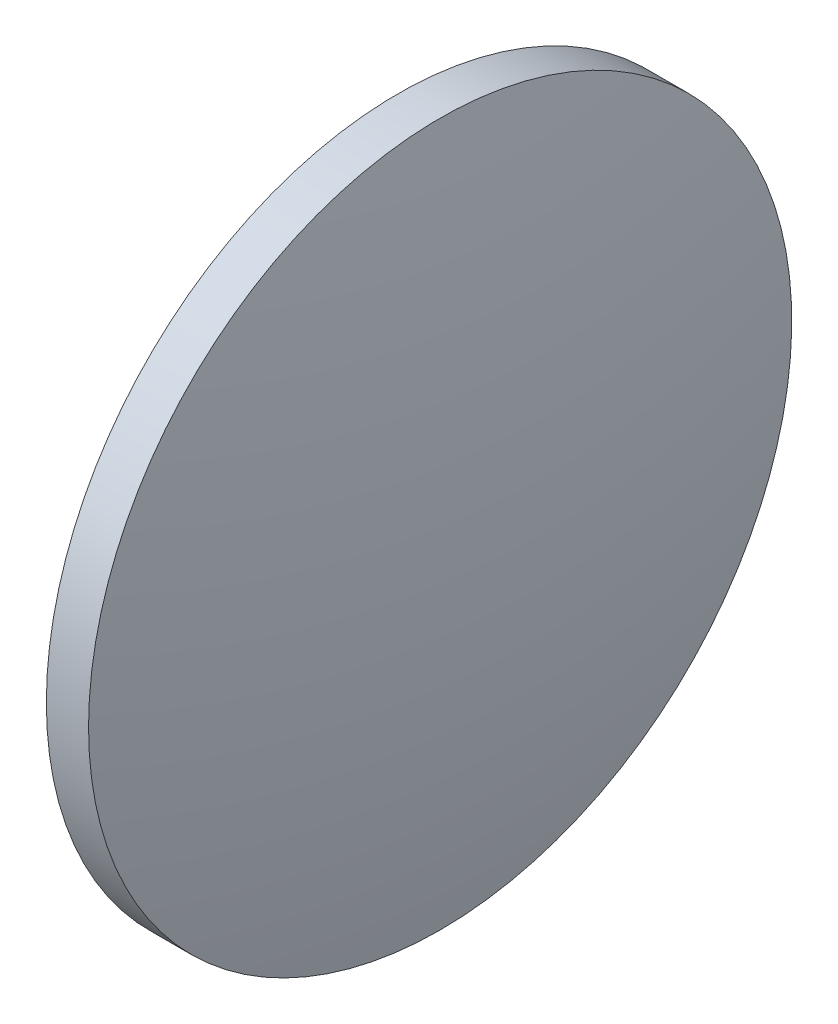
ISO-10303-21;
HEADER;
FILE_DESCRIPTION(('STEP AP214'),'2;1');
FILE_NAME('part.step','',(''),(''),'','','');
FILE_SCHEMA(('AUTOMOTIVE_DESIGN { 1 0 10303 214 1 1 1 1 }'));
ENDSEC;
DATA;
#1=APPLICATION_CONTEXT('core data for automotive mechanical design processes');
#2=APPLICATION_PROTOCOL_DEFINITION('international standard','automotive_design',2000,#1);
#3=PRODUCT_CONTEXT('',#1,'mechanical');
#4=PRODUCT('Part','Part','',(#3));
#5=PRODUCT_RELATED_PRODUCT_CATEGORY('part','',(#4));
#6=PRODUCT_DEFINITION_FORMATION('','',#4);
#7=PRODUCT_DEFINITION_CONTEXT('part definition',#1,'design');
#8=PRODUCT_DEFINITION('design','',#6,#7);
#9=PRODUCT_DEFINITION_SHAPE('','',#8);
#10=(LENGTH_UNIT() NAMED_UNIT(*) SI_UNIT(.MILLI.,.METRE.));
#11=(NAMED_UNIT(*) PLANE_ANGLE_UNIT() SI_UNIT($,.RADIAN.));
#12=(NAMED_UNIT(*) SI_UNIT($,.STERADIAN.) SOLID_ANGLE_UNIT());
#13=UNCERTAINTY_MEASURE_WITH_UNIT(LENGTH_MEASURE(1.E-05),#10,'distance_accuracy_value','');
#14=(GEOMETRIC_REPRESENTATION_CONTEXT(3) GLOBAL_UNCERTAINTY_ASSIGNED_CONTEXT((#13)) GLOBAL_UNIT_ASSIGNED_CONTEXT((#10,
#11,#12)) REPRESENTATION_CONTEXT('',''));
#15=CARTESIAN_POINT('',(0.,0.,0.));
#16=DIRECTION('',(0.,0.,1.));
#17=DIRECTION('',(1.,0.,0.));
#18=AXIS2_PLACEMENT_3D('',#15,#16,#17);
#19=CARTESIAN_POINT('',(328.41741118522,-45.5783623578756,0.));
#20=DIRECTION('',(-1.,0.,0.));
#21=DIRECTION('',(0.,-1.,0.));
#22=AXIS2_PLACEMENT_3D('',#19,#20,#21);
#23=SPHERICAL_SURFACE('',#22,129.293770491803);
#24=CARTESIAN_POINT('',(455.271181677023,-45.5783623578757,0.));
#25=DIRECTION('',(-1.,0.,0.));
#26=DIRECTION('',(0.,0.,1.));
#27=AXIS2_PLACEMENT_3D('',#24,#25,#26);
#28=CIRCLE('',#27,25.);
#29=CARTESIAN_POINT('',(455.271181677023,-45.5783623578757,25.));
#30=VERTEX_POINT('',#29);
#31=EDGE_CURVE('E10',#30,#30,#28,.T.);
#32=ORIENTED_EDGE('',*,*,#31,.F.);
#33=EDGE_LOOP('',(#32));
#34=FACE_BOUND('',#33,.T.);
#35=ADVANCED_FACE('F35',(#34),#23,.T.);
#36=CARTESIAN_POINT('',(448.126169927782,-45.5783623578757,0.));
#37=DIRECTION('',(-1.,0.,0.));
#38=DIRECTION('',(0.,0.,1.));
#39=AXIS2_PLACEMENT_3D('',#36,#37,#38);
#40=CYLINDRICAL_SURFACE('',#39,25.);
#41=CARTESIAN_POINT('',(452.271181677023,-45.5783623578757,0.));
#42=DIRECTION('',(-1.,0.,0.));
#43=DIRECTION('',(0.,0.,1.));
#44=AXIS2_PLACEMENT_3D('',#41,#42,#43);
#45=CIRCLE('',#44,25.);
#46=CARTESIAN_POINT('',(452.271181677023,-45.5783623578757,25.));
#47=VERTEX_POINT('',#46);
#48=EDGE_CURVE('E41',#47,#47,#45,.T.);
#49=ORIENTED_EDGE('',*,*,#48,.F.);
#50=EDGE_LOOP('',(#49));
#51=FACE_BOUND('',#50,.T.);
#52=ORIENTED_EDGE('',*,*,#31,.T.);
#53=EDGE_LOOP('',(#52));
#54=FACE_BOUND('',#53,.T.);
#55=ADVANCED_FACE('F49',(#51,#54),#40,.T.);
#56=CARTESIAN_POINT('',(452.271181677023,-45.5783623578757,0.));
#57=DIRECTION('',(1.,0.,0.));
#58=DIRECTION('',(0.,0.,-1.));
#59=AXIS2_PLACEMENT_3D('',#56,#57,#58);
#60=PLANE('',#59);
#61=ORIENTED_EDGE('',*,*,#48,.T.);
#62=EDGE_LOOP('',(#61));
#63=FACE_BOUND('',#62,.T.);
#64=ADVANCED_FACE('F47',(#63),#60,.F.);
#65=CLOSED_SHELL('',(#35,#55,#64));
#66=MANIFOLD_SOLID_BREP('B2',#65);
#67=ADVANCED_BREP_SHAPE_REPRESENTATION('',(#18,#66),#14);
#68=SHAPE_DEFINITION_REPRESENTATION(#9,#67);
ENDSEC;
END-ISO-10303-21;
